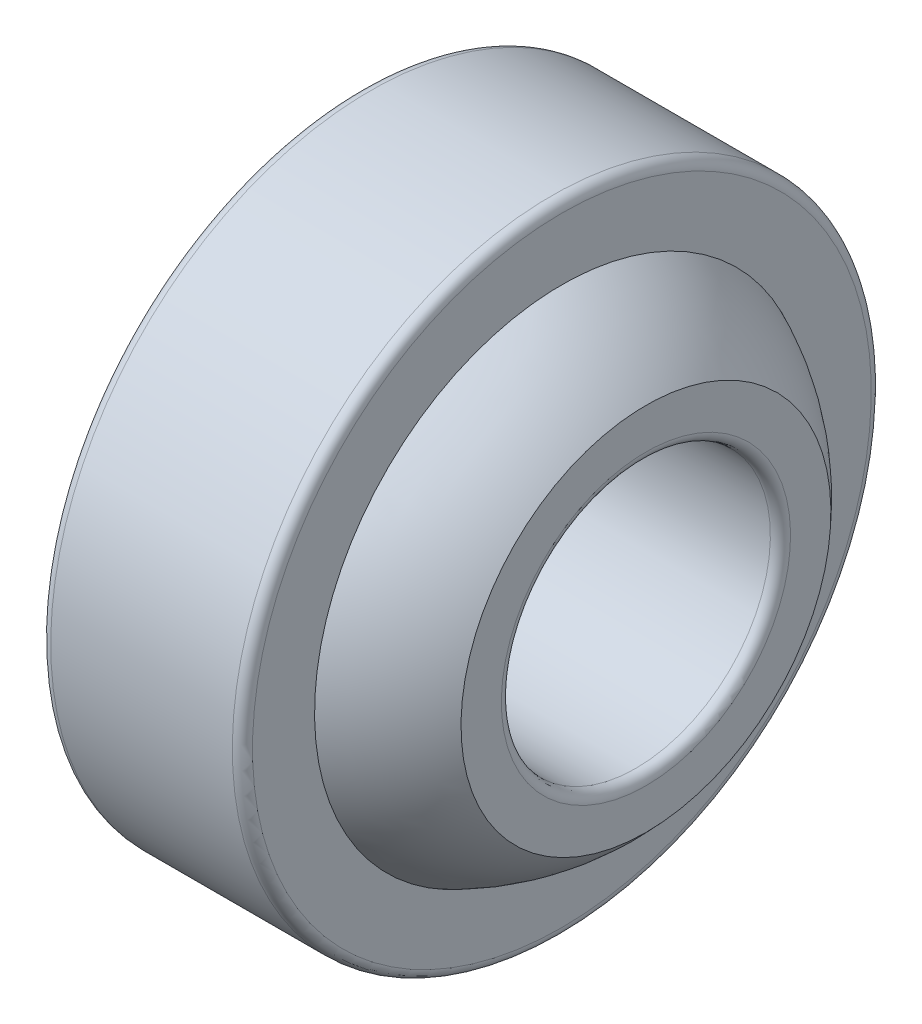
ISO-10303-21;
HEADER;
FILE_DESCRIPTION(('STEP AP214'),'2;1');
FILE_NAME('part.step','',(''),(''),'','','');
FILE_SCHEMA(('AUTOMOTIVE_DESIGN { 1 0 10303 214 1 1 1 1 }'));
ENDSEC;
DATA;
#1=APPLICATION_CONTEXT('core data for automotive mechanical design processes');
#2=APPLICATION_PROTOCOL_DEFINITION('international standard','automotive_design',2000,#1);
#3=PRODUCT_CONTEXT('',#1,'mechanical');
#4=PRODUCT('Part','Part','',(#3));
#5=PRODUCT_RELATED_PRODUCT_CATEGORY('part','',(#4));
#6=PRODUCT_DEFINITION_FORMATION('','',#4);
#7=PRODUCT_DEFINITION_CONTEXT('part definition',#1,'design');
#8=PRODUCT_DEFINITION('design','',#6,#7);
#9=PRODUCT_DEFINITION_SHAPE('','',#8);
#10=(LENGTH_UNIT() NAMED_UNIT(*) SI_UNIT(.MILLI.,.METRE.));
#11=(NAMED_UNIT(*) PLANE_ANGLE_UNIT() SI_UNIT($,.RADIAN.));
#12=(NAMED_UNIT(*) SI_UNIT($,.STERADIAN.) SOLID_ANGLE_UNIT());
#13=UNCERTAINTY_MEASURE_WITH_UNIT(LENGTH_MEASURE(1.E-05),#10,'distance_accuracy_value','');
#14=(GEOMETRIC_REPRESENTATION_CONTEXT(3) GLOBAL_UNCERTAINTY_ASSIGNED_CONTEXT((#13)) GLOBAL_UNIT_ASSIGNED_CONTEXT((#10,
#11,#12)) REPRESENTATION_CONTEXT('',''));
#15=CARTESIAN_POINT('',(0.,0.,0.));
#16=DIRECTION('',(0.,0.,1.));
#17=DIRECTION('',(1.,0.,0.));
#18=AXIS2_PLACEMENT_3D('',#15,#16,#17);
#19=CARTESIAN_POINT('',(0.,0.,0.));
#20=DIRECTION('',(-1.,0.,0.));
#21=DIRECTION('',(0.,-1.,0.));
#22=AXIS2_PLACEMENT_3D('',#19,#20,#21);
#23=DEGENERATE_TOROIDAL_SURFACE('',#22,0.699999999999997,7.3,.T.);
#24=CARTESIAN_POINT('',(-5.5,0.,0.));
#25=DIRECTION('',(1.,0.,0.));
#26=DIRECTION('',(0.,-1.,0.));
#27=AXIS2_PLACEMENT_3D('',#24,#25,#26);
#28=CIRCLE('',#27,5.5);
#29=CARTESIAN_POINT('',(-5.5,-5.5,0.));
#30=VERTEX_POINT('',#29);
#31=EDGE_CURVE('E11',#30,#30,#28,.T.);
#32=ORIENTED_EDGE('',*,*,#31,.T.);
#33=EDGE_LOOP('',(#32));
#34=FACE_BOUND('',#33,.T.);
#35=CARTESIAN_POINT('',(5.5,0.,0.));
#36=DIRECTION('',(1.,0.,0.));
#37=DIRECTION('',(0.,-1.,0.));
#38=AXIS2_PLACEMENT_3D('',#35,#36,#37);
#39=CIRCLE('',#38,5.5);
#40=CARTESIAN_POINT('',(5.5,-5.5,0.));
#41=VERTEX_POINT('',#40);
#42=EDGE_CURVE('E63',#41,#41,#39,.T.);
#43=ORIENTED_EDGE('',*,*,#42,.F.);
#44=EDGE_LOOP('',(#43));
#45=FACE_BOUND('',#44,.T.);
#46=ADVANCED_FACE('F41',(#34,#45),#23,.T.);
#47=CARTESIAN_POINT('',(-5.5,5.5,0.));
#48=DIRECTION('',(1.,0.,0.));
#49=DIRECTION('',(0.,1.,0.));
#50=AXIS2_PLACEMENT_3D('',#47,#48,#49);
#51=PLANE('',#50);
#52=CARTESIAN_POINT('',(-5.5,0.,0.));
#53=DIRECTION('',(1.,0.,0.));
#54=DIRECTION('',(0.,-1.,0.));
#55=AXIS2_PLACEMENT_3D('',#52,#53,#54);
#56=CIRCLE('',#55,4.3);
#57=CARTESIAN_POINT('',(-5.5,-4.3,0.));
#58=VERTEX_POINT('',#57);
#59=EDGE_CURVE('E47',#58,#58,#56,.T.);
#60=ORIENTED_EDGE('',*,*,#59,.T.);
#61=EDGE_LOOP('',(#60));
#62=FACE_BOUND('',#61,.T.);
#63=ORIENTED_EDGE('',*,*,#31,.F.);
#64=EDGE_LOOP('',(#63));
#65=FACE_BOUND('',#64,.T.);
#66=ADVANCED_FACE('F71',(#62,#65),#51,.F.);
#67=CARTESIAN_POINT('',(-5.2,0.,0.));
#68=DIRECTION('',(-1.,0.,0.));
#69=DIRECTION('',(0.,-1.,0.));
#70=AXIS2_PLACEMENT_3D('',#67,#68,#69);
#71=TOROIDAL_SURFACE('',#70,4.3,0.3);
#72=CARTESIAN_POINT('',(-5.2,0.,0.));
#73=DIRECTION('',(1.,0.,0.));
#74=DIRECTION('',(0.,-1.,0.));
#75=AXIS2_PLACEMENT_3D('',#72,#73,#74);
#76=CIRCLE('',#75,4.);
#77=CARTESIAN_POINT('',(-5.2,-4.,0.));
#78=VERTEX_POINT('',#77);
#79=EDGE_CURVE('E51',#78,#78,#76,.T.);
#80=ORIENTED_EDGE('',*,*,#79,.T.);
#81=EDGE_LOOP('',(#80));
#82=FACE_BOUND('',#81,.T.);
#83=ORIENTED_EDGE('',*,*,#59,.F.);
#84=EDGE_LOOP('',(#83));
#85=FACE_BOUND('',#84,.T.);
#86=ADVANCED_FACE('F75',(#82,#85),#71,.T.);
#87=CARTESIAN_POINT('',(-7.,0.,0.));
#88=DIRECTION('',(-1.,0.,0.));
#89=DIRECTION('',(0.,-1.,0.));
#90=AXIS2_PLACEMENT_3D('',#87,#88,#89);
#91=CYLINDRICAL_SURFACE('',#90,4.);
#92=CARTESIAN_POINT('',(5.2,0.,0.));
#93=DIRECTION('',(1.,0.,0.));
#94=DIRECTION('',(0.,-1.,0.));
#95=AXIS2_PLACEMENT_3D('',#92,#93,#94);
#96=CIRCLE('',#95,4.);
#97=CARTESIAN_POINT('',(5.2,-4.,0.));
#98=VERTEX_POINT('',#97);
#99=EDGE_CURVE('E55',#98,#98,#96,.T.);
#100=ORIENTED_EDGE('',*,*,#99,.T.);
#101=EDGE_LOOP('',(#100));
#102=FACE_BOUND('',#101,.T.);
#103=ORIENTED_EDGE('',*,*,#79,.F.);
#104=EDGE_LOOP('',(#103));
#105=FACE_BOUND('',#104,.T.);
#106=ADVANCED_FACE('F79',(#102,#105),#91,.F.);
#107=CARTESIAN_POINT('',(5.2,0.,0.));
#108=DIRECTION('',(-1.,0.,0.));
#109=DIRECTION('',(0.,-1.,0.));
#110=AXIS2_PLACEMENT_3D('',#107,#108,#109);
#111=TOROIDAL_SURFACE('',#110,4.3,0.299999999999999);
#112=CARTESIAN_POINT('',(5.5,0.,0.));
#113=DIRECTION('',(1.,0.,0.));
#114=DIRECTION('',(0.,-1.,0.));
#115=AXIS2_PLACEMENT_3D('',#112,#113,#114);
#116=CIRCLE('',#115,4.3);
#117=CARTESIAN_POINT('',(5.5,-4.3,0.));
#118=VERTEX_POINT('',#117);
#119=EDGE_CURVE('E60',#118,#118,#116,.T.);
#120=ORIENTED_EDGE('',*,*,#119,.T.);
#121=EDGE_LOOP('',(#120));
#122=FACE_BOUND('',#121,.T.);
#123=ORIENTED_EDGE('',*,*,#99,.F.);
#124=EDGE_LOOP('',(#123));
#125=FACE_BOUND('',#124,.T.);
#126=ADVANCED_FACE('F86',(#122,#125),#111,.T.);
#127=CARTESIAN_POINT('',(5.5,5.5,0.));
#128=DIRECTION('',(-1.,0.,0.));
#129=DIRECTION('',(0.,-1.,0.));
#130=AXIS2_PLACEMENT_3D('',#127,#128,#129);
#131=PLANE('',#130);
#132=ORIENTED_EDGE('',*,*,#42,.T.);
#133=EDGE_LOOP('',(#132));
#134=FACE_BOUND('',#133,.T.);
#135=ORIENTED_EDGE('',*,*,#119,.F.);
#136=EDGE_LOOP('',(#135));
#137=FACE_BOUND('',#136,.T.);
#138=ADVANCED_FACE('F67',(#134,#137),#131,.F.);
#139=CLOSED_SHELL('',(#46,#66,#86,#106,#126,#138));
#140=MANIFOLD_SOLID_BREP('B2',#139);
#141=CARTESIAN_POINT('',(0.,0.,0.));
#142=DIRECTION('',(-1.,0.,0.));
#143=DIRECTION('',(0.,-1.,0.));
#144=AXIS2_PLACEMENT_3D('',#141,#142,#143);
#145=DEGENERATE_TOROIDAL_SURFACE('',#144,0.699999999999997,7.3,.T.);
#146=CARTESIAN_POINT('',(3.,0.,0.));
#147=DIRECTION('',(1.,0.,0.));
#148=DIRECTION('',(0.,-1.,0.));
#149=AXIS2_PLACEMENT_3D('',#146,#147,#148);
#150=CIRCLE('',#149,7.35507325278993);
#151=CARTESIAN_POINT('',(3.,-7.35507325278993,0.));
#152=VERTEX_POINT('',#151);
#153=EDGE_CURVE('E40',#152,#152,#150,.T.);
#154=ORIENTED_EDGE('',*,*,#153,.T.);
#155=EDGE_LOOP('',(#154));
#156=FACE_BOUND('',#155,.T.);
#157=CARTESIAN_POINT('',(-3.,0.,0.));
#158=DIRECTION('',(1.,0.,0.));
#159=DIRECTION('',(0.,-1.,0.));
#160=AXIS2_PLACEMENT_3D('',#157,#158,#159);
#161=CIRCLE('',#160,7.35507325278993);
#162=CARTESIAN_POINT('',(-3.,-7.35507325278993,0.));
#163=VERTEX_POINT('',#162);
#164=EDGE_CURVE('E155',#163,#163,#161,.T.);
#165=ORIENTED_EDGE('',*,*,#164,.F.);
#166=EDGE_LOOP('',(#165));
#167=FACE_BOUND('',#166,.T.);
#168=ADVANCED_FACE('F133',(#156,#167),#145,.F.);
#169=CARTESIAN_POINT('',(3.,9.2,0.));
#170=DIRECTION('',(-1.,0.,0.));
#171=DIRECTION('',(0.,-1.,0.));
#172=AXIS2_PLACEMENT_3D('',#169,#170,#171);
#173=PLANE('',#172);
#174=CARTESIAN_POINT('',(3.,0.,0.));
#175=DIRECTION('',(1.,0.,0.));
#176=DIRECTION('',(0.,-1.,0.));
#177=AXIS2_PLACEMENT_3D('',#174,#175,#176);
#178=CIRCLE('',#177,9.2);
#179=CARTESIAN_POINT('',(3.,-9.2,0.));
#180=VERTEX_POINT('',#179);
#181=EDGE_CURVE('E139',#180,#180,#178,.T.);
#182=ORIENTED_EDGE('',*,*,#181,.T.);
#183=EDGE_LOOP('',(#182));
#184=FACE_BOUND('',#183,.T.);
#185=ORIENTED_EDGE('',*,*,#153,.F.);
#186=EDGE_LOOP('',(#185));
#187=FACE_BOUND('',#186,.T.);
#188=ADVANCED_FACE('F163',(#184,#187),#173,.F.);
#189=CARTESIAN_POINT('',(2.7,0.,0.));
#190=DIRECTION('',(-1.,0.,0.));
#191=DIRECTION('',(0.,-1.,0.));
#192=AXIS2_PLACEMENT_3D('',#189,#190,#191);
#193=TOROIDAL_SURFACE('',#192,9.2,0.3);
#194=CARTESIAN_POINT('',(2.7,0.,0.));
#195=DIRECTION('',(1.,0.,0.));
#196=DIRECTION('',(0.,-1.,0.));
#197=AXIS2_PLACEMENT_3D('',#194,#195,#196);
#198=CIRCLE('',#197,9.5);
#199=CARTESIAN_POINT('',(2.70000000000001,-9.5,0.));
#200=VERTEX_POINT('',#199);
#201=EDGE_CURVE('E143',#200,#200,#198,.T.);
#202=ORIENTED_EDGE('',*,*,#201,.T.);
#203=EDGE_LOOP('',(#202));
#204=FACE_BOUND('',#203,.T.);
#205=ORIENTED_EDGE('',*,*,#181,.F.);
#206=EDGE_LOOP('',(#205));
#207=FACE_BOUND('',#206,.T.);
#208=ADVANCED_FACE('F167',(#204,#207),#193,.T.);
#209=CARTESIAN_POINT('',(-7.,0.,0.));
#210=DIRECTION('',(-1.,0.,0.));
#211=DIRECTION('',(0.,-1.,0.));
#212=AXIS2_PLACEMENT_3D('',#209,#210,#211);
#213=CYLINDRICAL_SURFACE('',#212,9.5);
#214=CARTESIAN_POINT('',(-2.7,0.,0.));
#215=DIRECTION('',(1.,0.,0.));
#216=DIRECTION('',(0.,-1.,0.));
#217=AXIS2_PLACEMENT_3D('',#214,#215,#216);
#218=CIRCLE('',#217,9.5);
#219=CARTESIAN_POINT('',(-2.7,-9.5,0.));
#220=VERTEX_POINT('',#219);
#221=EDGE_CURVE('E147',#220,#220,#218,.T.);
#222=ORIENTED_EDGE('',*,*,#221,.T.);
#223=EDGE_LOOP('',(#222));
#224=FACE_BOUND('',#223,.T.);
#225=ORIENTED_EDGE('',*,*,#201,.F.);
#226=EDGE_LOOP('',(#225));
#227=FACE_BOUND('',#226,.T.);
#228=ADVANCED_FACE('F171',(#224,#227),#213,.T.);
#229=CARTESIAN_POINT('',(-2.7,0.,0.));
#230=DIRECTION('',(-1.,0.,0.));
#231=DIRECTION('',(0.,-1.,0.));
#232=AXIS2_PLACEMENT_3D('',#229,#230,#231);
#233=TOROIDAL_SURFACE('',#232,9.2,0.3);
#234=CARTESIAN_POINT('',(-3.,0.,0.));
#235=DIRECTION('',(1.,0.,0.));
#236=DIRECTION('',(0.,-1.,0.));
#237=AXIS2_PLACEMENT_3D('',#234,#235,#236);
#238=CIRCLE('',#237,9.2);
#239=CARTESIAN_POINT('',(-3.,-9.2,0.));
#240=VERTEX_POINT('',#239);
#241=EDGE_CURVE('E152',#240,#240,#238,.T.);
#242=ORIENTED_EDGE('',*,*,#241,.T.);
#243=EDGE_LOOP('',(#242));
#244=FACE_BOUND('',#243,.T.);
#245=ORIENTED_EDGE('',*,*,#221,.F.);
#246=EDGE_LOOP('',(#245));
#247=FACE_BOUND('',#246,.T.);
#248=ADVANCED_FACE('F178',(#244,#247),#233,.T.);
#249=CARTESIAN_POINT('',(-3.,7.35507325278993,0.));
#250=DIRECTION('',(1.,0.,0.));
#251=DIRECTION('',(0.,1.,0.));
#252=AXIS2_PLACEMENT_3D('',#249,#250,#251);
#253=PLANE('',#252);
#254=ORIENTED_EDGE('',*,*,#164,.T.);
#255=EDGE_LOOP('',(#254));
#256=FACE_BOUND('',#255,.T.);
#257=ORIENTED_EDGE('',*,*,#241,.F.);
#258=EDGE_LOOP('',(#257));
#259=FACE_BOUND('',#258,.T.);
#260=ADVANCED_FACE('F159',(#256,#259),#253,.F.);
#261=CLOSED_SHELL('',(#168,#188,#208,#228,#248,#260));
#262=MANIFOLD_SOLID_BREP('B6',#261);
#263=ADVANCED_BREP_SHAPE_REPRESENTATION('',(#18,#140,#262),#14);
#264=SHAPE_DEFINITION_REPRESENTATION(#9,#263);
ENDSEC;
END-ISO-10303-21;
